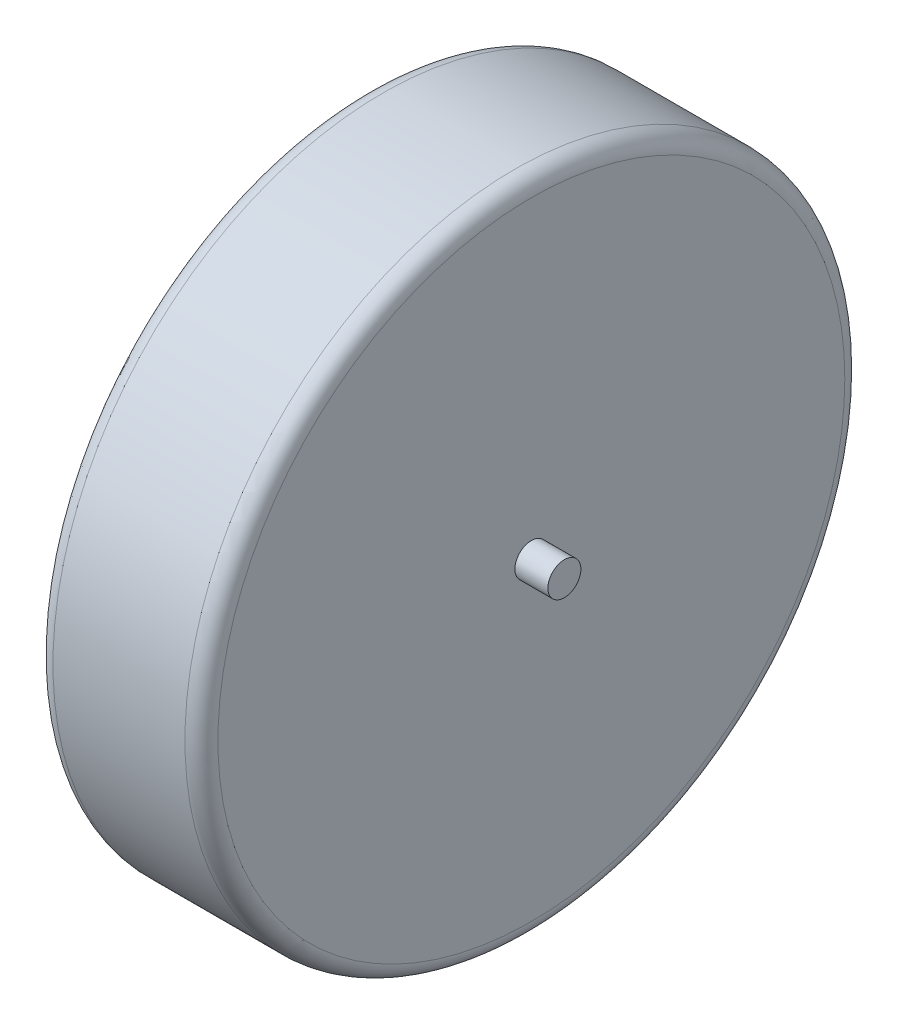
ISO-10303-21;
HEADER;
FILE_DESCRIPTION(('STEP AP214'),'2;1');
FILE_NAME('part.step','',(''),(''),'','','');
FILE_SCHEMA(('AUTOMOTIVE_DESIGN { 1 0 10303 214 1 1 1 1 }'));
ENDSEC;
DATA;
#1=APPLICATION_CONTEXT('core data for automotive mechanical design processes');
#2=APPLICATION_PROTOCOL_DEFINITION('international standard','automotive_design',2000,#1);
#3=PRODUCT_CONTEXT('',#1,'mechanical');
#4=PRODUCT('Part','Part','',(#3));
#5=PRODUCT_RELATED_PRODUCT_CATEGORY('part','',(#4));
#6=PRODUCT_DEFINITION_FORMATION('','',#4);
#7=PRODUCT_DEFINITION_CONTEXT('part definition',#1,'design');
#8=PRODUCT_DEFINITION('design','',#6,#7);
#9=PRODUCT_DEFINITION_SHAPE('','',#8);
#10=(LENGTH_UNIT() NAMED_UNIT(*) SI_UNIT(.MILLI.,.METRE.));
#11=(NAMED_UNIT(*) PLANE_ANGLE_UNIT() SI_UNIT($,.RADIAN.));
#12=(NAMED_UNIT(*) SI_UNIT($,.STERADIAN.) SOLID_ANGLE_UNIT());
#13=UNCERTAINTY_MEASURE_WITH_UNIT(LENGTH_MEASURE(1.E-05),#10,'distance_accuracy_value','');
#14=(GEOMETRIC_REPRESENTATION_CONTEXT(3) GLOBAL_UNCERTAINTY_ASSIGNED_CONTEXT((#13)) GLOBAL_UNIT_ASSIGNED_CONTEXT((#10,
#11,#12)) REPRESENTATION_CONTEXT('',''));
#15=CARTESIAN_POINT('',(0.,0.,0.));
#16=DIRECTION('',(0.,0.,1.));
#17=DIRECTION('',(1.,0.,0.));
#18=AXIS2_PLACEMENT_3D('',#15,#16,#17);
#19=CARTESIAN_POINT('',(10.,0.,0.));
#20=DIRECTION('',(-1.,0.,0.));
#21=DIRECTION('',(0.,0.,1.));
#22=AXIS2_PLACEMENT_3D('',#19,#20,#21);
#23=CYLINDRICAL_SURFACE('',#22,20.);
#24=CARTESIAN_POINT('',(9.,0.,0.));
#25=DIRECTION('',(1.,0.,0.));
#26=DIRECTION('',(0.,0.,-1.));
#27=AXIS2_PLACEMENT_3D('',#24,#25,#26);
#28=CIRCLE('',#27,20.);
#29=CARTESIAN_POINT('',(9.,0.,-20.));
#30=VERTEX_POINT('',#29);
#31=EDGE_CURVE('E45',#30,#30,#28,.F.);
#32=ORIENTED_EDGE('',*,*,#31,.T.);
#33=EDGE_LOOP('',(#32));
#34=FACE_BOUND('',#33,.T.);
#35=CARTESIAN_POINT('',(0.999999999999999,0.,0.));
#36=DIRECTION('',(1.,0.,0.));
#37=DIRECTION('',(0.,0.,-1.));
#38=AXIS2_PLACEMENT_3D('',#35,#36,#37);
#39=CIRCLE('',#38,20.);
#40=CARTESIAN_POINT('',(0.999999999999999,0.,-20.));
#41=VERTEX_POINT('',#40);
#42=EDGE_CURVE('E50',#41,#41,#39,.T.);
#43=ORIENTED_EDGE('',*,*,#42,.T.);
#44=EDGE_LOOP('',(#43));
#45=FACE_BOUND('',#44,.T.);
#46=ADVANCED_FACE('F37',(#34,#45),#23,.T.);
#47=CARTESIAN_POINT('',(10.,0.,0.));
#48=DIRECTION('',(1.,0.,0.));
#49=DIRECTION('',(0.,0.,-1.));
#50=AXIS2_PLACEMENT_3D('',#47,#48,#49);
#51=PLANE('',#50);
#52=CARTESIAN_POINT('',(10.,0.,0.));
#53=DIRECTION('',(1.,0.,0.));
#54=DIRECTION('',(0.,0.,-1.));
#55=AXIS2_PLACEMENT_3D('',#52,#53,#54);
#56=CIRCLE('',#55,19.);
#57=CARTESIAN_POINT('',(10.,0.,-19.));
#58=VERTEX_POINT('',#57);
#59=EDGE_CURVE('E55',#58,#58,#56,.T.);
#60=ORIENTED_EDGE('',*,*,#59,.T.);
#61=EDGE_LOOP('',(#60));
#62=FACE_BOUND('',#61,.T.);
#63=CARTESIAN_POINT('',(10.,0.,0.));
#64=DIRECTION('',(1.,0.,0.));
#65=DIRECTION('',(0.,0.,-1.));
#66=AXIS2_PLACEMENT_3D('',#63,#64,#65);
#67=CIRCLE('',#66,1.);
#68=CARTESIAN_POINT('',(10.,0.,-1.));
#69=VERTEX_POINT('',#68);
#70=EDGE_CURVE('E66',#69,#69,#67,.T.);
#71=ORIENTED_EDGE('',*,*,#70,.F.);
#72=EDGE_LOOP('',(#71));
#73=FACE_BOUND('',#72,.T.);
#74=ADVANCED_FACE('F90',(#62,#73),#51,.T.);
#75=CARTESIAN_POINT('',(0.,0.,0.));
#76=DIRECTION('',(1.,0.,0.));
#77=DIRECTION('',(0.,0.,-1.));
#78=AXIS2_PLACEMENT_3D('',#75,#76,#77);
#79=PLANE('',#78);
#80=CARTESIAN_POINT('',(0.,0.,0.));
#81=DIRECTION('',(1.,0.,0.));
#82=DIRECTION('',(0.,0.,-1.));
#83=AXIS2_PLACEMENT_3D('',#80,#81,#82);
#84=CIRCLE('',#83,19.);
#85=CARTESIAN_POINT('',(0.,0.,-19.));
#86=VERTEX_POINT('',#85);
#87=EDGE_CURVE('E10',#86,#86,#84,.F.);
#88=ORIENTED_EDGE('',*,*,#87,.T.);
#89=EDGE_LOOP('',(#88));
#90=FACE_BOUND('',#89,.T.);
#91=CARTESIAN_POINT('',(0.,0.,0.));
#92=DIRECTION('',(1.,0.,0.));
#93=DIRECTION('',(0.,0.,-1.));
#94=AXIS2_PLACEMENT_3D('',#91,#92,#93);
#95=CIRCLE('',#94,1.);
#96=CARTESIAN_POINT('',(0.,0.,-1.));
#97=VERTEX_POINT('',#96);
#98=EDGE_CURVE('E61',#97,#97,#95,.F.);
#99=ORIENTED_EDGE('',*,*,#98,.F.);
#100=EDGE_LOOP('',(#99));
#101=FACE_BOUND('',#100,.T.);
#102=ADVANCED_FACE('F87',(#90,#101),#79,.F.);
#103=CARTESIAN_POINT('',(12.,0.,0.));
#104=DIRECTION('',(-1.,0.,0.));
#105=DIRECTION('',(0.,0.,1.));
#106=AXIS2_PLACEMENT_3D('',#103,#104,#105);
#107=CYLINDRICAL_SURFACE('',#106,1.);
#108=CARTESIAN_POINT('',(12.,0.,0.));
#109=DIRECTION('',(1.,0.,0.));
#110=DIRECTION('',(0.,0.,-1.));
#111=AXIS2_PLACEMENT_3D('',#108,#109,#110);
#112=CIRCLE('',#111,1.);
#113=CARTESIAN_POINT('',(12.,0.,-1.));
#114=VERTEX_POINT('',#113);
#115=EDGE_CURVE('E65',#114,#114,#112,.T.);
#116=ORIENTED_EDGE('',*,*,#115,.F.);
#117=EDGE_LOOP('',(#116));
#118=FACE_BOUND('',#117,.T.);
#119=ORIENTED_EDGE('',*,*,#70,.T.);
#120=EDGE_LOOP('',(#119));
#121=FACE_BOUND('',#120,.T.);
#122=ADVANCED_FACE('F89',(#118,#121),#107,.T.);
#123=CARTESIAN_POINT('',(12.,0.,0.));
#124=DIRECTION('',(1.,0.,0.));
#125=DIRECTION('',(0.,0.,-1.));
#126=AXIS2_PLACEMENT_3D('',#123,#124,#125);
#127=PLANE('',#126);
#128=ORIENTED_EDGE('',*,*,#115,.T.);
#129=EDGE_LOOP('',(#128));
#130=FACE_BOUND('',#129,.T.);
#131=ADVANCED_FACE('F83',(#130),#127,.T.);
#132=CARTESIAN_POINT('',(-2.,0.,0.));
#133=DIRECTION('',(1.,0.,0.));
#134=DIRECTION('',(0.,0.,-1.));
#135=AXIS2_PLACEMENT_3D('',#132,#133,#134);
#136=CYLINDRICAL_SURFACE('',#135,1.);
#137=CARTESIAN_POINT('',(-2.,0.,0.));
#138=DIRECTION('',(-1.,0.,0.));
#139=DIRECTION('',(0.,0.,1.));
#140=AXIS2_PLACEMENT_3D('',#137,#138,#139);
#141=CIRCLE('',#140,1.);
#142=CARTESIAN_POINT('',(-2.,0.,1.));
#143=VERTEX_POINT('',#142);
#144=EDGE_CURVE('E70',#143,#143,#141,.T.);
#145=ORIENTED_EDGE('',*,*,#144,.F.);
#146=EDGE_LOOP('',(#145));
#147=FACE_BOUND('',#146,.T.);
#148=ORIENTED_EDGE('',*,*,#98,.T.);
#149=EDGE_LOOP('',(#148));
#150=FACE_BOUND('',#149,.T.);
#151=ADVANCED_FACE('F80',(#147,#150),#136,.T.);
#152=CARTESIAN_POINT('',(-2.,0.,0.));
#153=DIRECTION('',(-1.,0.,0.));
#154=DIRECTION('',(0.,0.,1.));
#155=AXIS2_PLACEMENT_3D('',#152,#153,#154);
#156=PLANE('',#155);
#157=ORIENTED_EDGE('',*,*,#144,.T.);
#158=EDGE_LOOP('',(#157));
#159=FACE_BOUND('',#158,.T.);
#160=ADVANCED_FACE('F78',(#159),#156,.T.);
#161=CARTESIAN_POINT('',(9.,0.,0.));
#162=DIRECTION('',(1.,0.,0.));
#163=DIRECTION('',(0.,0.,-1.));
#164=AXIS2_PLACEMENT_3D('',#161,#162,#163);
#165=TOROIDAL_SURFACE('',#164,19.,1.);
#166=ORIENTED_EDGE('',*,*,#31,.F.);
#167=EDGE_LOOP('',(#166));
#168=FACE_BOUND('',#167,.T.);
#169=ORIENTED_EDGE('',*,*,#59,.F.);
#170=EDGE_LOOP('',(#169));
#171=FACE_BOUND('',#170,.T.);
#172=ADVANCED_FACE('F105',(#168,#171),#165,.T.);
#173=CARTESIAN_POINT('',(0.999999999999999,0.,0.));
#174=DIRECTION('',(1.,0.,0.));
#175=DIRECTION('',(0.,0.,-1.));
#176=AXIS2_PLACEMENT_3D('',#173,#174,#175);
#177=TOROIDAL_SURFACE('',#176,19.,1.);
#178=ORIENTED_EDGE('',*,*,#87,.F.);
#179=EDGE_LOOP('',(#178));
#180=FACE_BOUND('',#179,.T.);
#181=ORIENTED_EDGE('',*,*,#42,.F.);
#182=EDGE_LOOP('',(#181));
#183=FACE_BOUND('',#182,.T.);
#184=ADVANCED_FACE('F39',(#180,#183),#177,.T.);
#185=CLOSED_SHELL('',(#46,#74,#102,#122,#131,#151,#160,#172,#184));
#186=MANIFOLD_SOLID_BREP('B2',#185);
#187=ADVANCED_BREP_SHAPE_REPRESENTATION('',(#18,#186),#14);
#188=SHAPE_DEFINITION_REPRESENTATION(#9,#187);
ENDSEC;
END-ISO-10303-21;
